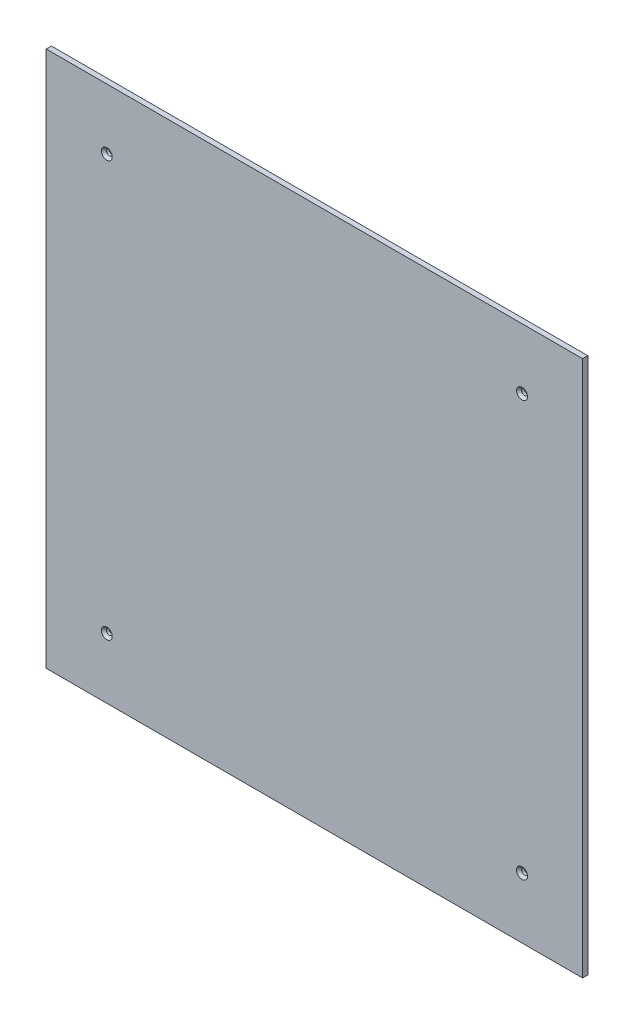
ISO-10303-21;
HEADER;
FILE_DESCRIPTION(('STEP AP214'),'2;1');
FILE_NAME('part.step','',(''),(''),'','','');
FILE_SCHEMA(('AUTOMOTIVE_DESIGN { 1 0 10303 214 1 1 1 1 }'));
ENDSEC;
DATA;
#1=APPLICATION_CONTEXT('core data for automotive mechanical design processes');
#2=APPLICATION_PROTOCOL_DEFINITION('international standard','automotive_design',2000,#1);
#3=PRODUCT_CONTEXT('',#1,'mechanical');
#4=PRODUCT('Part','Part','',(#3));
#5=PRODUCT_RELATED_PRODUCT_CATEGORY('part','',(#4));
#6=PRODUCT_DEFINITION_FORMATION('','',#4);
#7=PRODUCT_DEFINITION_CONTEXT('part definition',#1,'design');
#8=PRODUCT_DEFINITION('design','',#6,#7);
#9=PRODUCT_DEFINITION_SHAPE('','',#8);
#10=(LENGTH_UNIT() NAMED_UNIT(*) SI_UNIT(.MILLI.,.METRE.));
#11=(NAMED_UNIT(*) PLANE_ANGLE_UNIT() SI_UNIT($,.RADIAN.));
#12=(NAMED_UNIT(*) SI_UNIT($,.STERADIAN.) SOLID_ANGLE_UNIT());
#13=UNCERTAINTY_MEASURE_WITH_UNIT(LENGTH_MEASURE(1.E-05),#10,'distance_accuracy_value','');
#14=(GEOMETRIC_REPRESENTATION_CONTEXT(3) GLOBAL_UNCERTAINTY_ASSIGNED_CONTEXT((#13)) GLOBAL_UNIT_ASSIGNED_CONTEXT((#10,
#11,#12)) REPRESENTATION_CONTEXT('',''));
#15=CARTESIAN_POINT('',(0.,0.,0.));
#16=DIRECTION('',(0.,0.,1.));
#17=DIRECTION('',(1.,0.,0.));
#18=AXIS2_PLACEMENT_3D('',#15,#16,#17);
#19=CARTESIAN_POINT('',(-143.295194508009,104.988558352403,-3.));
#20=DIRECTION('',(-1.,0.,0.));
#21=DIRECTION('',(0.,-1.,0.));
#22=AXIS2_PLACEMENT_3D('',#19,#20,#21);
#23=PLANE('',#22);
#24=DIRECTION('',(0.,-1.,0.));
#25=VECTOR('',#24,1.);
#26=CARTESIAN_POINT('',(-143.295194508009,104.988558352403,0.));
#27=LINE('',#26,#25);
#28=CARTESIAN_POINT('',(-143.295194508009,104.988558352403,0.));
#29=VERTEX_POINT('',#28);
#30=CARTESIAN_POINT('',(-143.295194508009,-205.011441647597,0.));
#31=VERTEX_POINT('',#30);
#32=EDGE_CURVE('E110',#29,#31,#27,.T.);
#33=ORIENTED_EDGE('',*,*,#32,.F.);
#34=DIRECTION('',(0.,0.,1.));
#35=VECTOR('',#34,1.);
#36=CARTESIAN_POINT('',(-143.295194508009,104.988558352403,-3.));
#37=LINE('',#36,#35);
#38=CARTESIAN_POINT('',(-143.295194508009,104.988558352403,-3.));
#39=VERTEX_POINT('',#38);
#40=EDGE_CURVE('E11',#39,#29,#37,.T.);
#41=ORIENTED_EDGE('',*,*,#40,.F.);
#42=DIRECTION('',(0.,-1.,0.));
#43=VECTOR('',#42,1.);
#44=CARTESIAN_POINT('',(-143.295194508009,104.988558352403,-3.));
#45=LINE('',#44,#43);
#46=CARTESIAN_POINT('',(-143.295194508009,-205.011441647597,-3.));
#47=VERTEX_POINT('',#46);
#48=EDGE_CURVE('E101',#39,#47,#45,.T.);
#49=ORIENTED_EDGE('',*,*,#48,.T.);
#50=DIRECTION('',(0.,0.,1.));
#51=VECTOR('',#50,1.);
#52=CARTESIAN_POINT('',(-143.295194508009,-205.011441647597,-3.));
#53=LINE('',#52,#51);
#54=EDGE_CURVE('E42',#47,#31,#53,.T.);
#55=ORIENTED_EDGE('',*,*,#54,.T.);
#56=EDGE_LOOP('',(#33,#41,#49,#55));
#57=FACE_BOUND('',#56,.T.);
#58=ADVANCED_FACE('F39',(#57),#23,.T.);
#59=CARTESIAN_POINT('',(-143.295194508009,104.988558352403,-3.));
#60=DIRECTION('',(0.,1.,0.));
#61=DIRECTION('',(0.,0.,1.));
#62=AXIS2_PLACEMENT_3D('',#59,#60,#61);
#63=PLANE('',#62);
#64=DIRECTION('',(-1.,0.,0.));
#65=VECTOR('',#64,1.);
#66=CARTESIAN_POINT('',(-143.295194508009,104.988558352403,0.));
#67=LINE('',#66,#65);
#68=CARTESIAN_POINT('',(166.704805491991,104.988558352403,0.));
#69=VERTEX_POINT('',#68);
#70=EDGE_CURVE('E104',#69,#29,#67,.T.);
#71=ORIENTED_EDGE('',*,*,#70,.F.);
#72=DIRECTION('',(0.,0.,1.));
#73=VECTOR('',#72,1.);
#74=CARTESIAN_POINT('',(166.704805491991,104.988558352403,-3.));
#75=LINE('',#74,#73);
#76=CARTESIAN_POINT('',(166.704805491991,104.988558352403,-3.));
#77=VERTEX_POINT('',#76);
#78=EDGE_CURVE('E49',#77,#69,#75,.T.);
#79=ORIENTED_EDGE('',*,*,#78,.F.);
#80=DIRECTION('',(-1.,0.,0.));
#81=VECTOR('',#80,1.);
#82=CARTESIAN_POINT('',(-143.295194508009,104.988558352403,-3.));
#83=LINE('',#82,#81);
#84=EDGE_CURVE('E96',#77,#39,#83,.T.);
#85=ORIENTED_EDGE('',*,*,#84,.T.);
#86=ORIENTED_EDGE('',*,*,#40,.T.);
#87=EDGE_LOOP('',(#71,#79,#85,#86));
#88=FACE_BOUND('',#87,.T.);
#89=ADVANCED_FACE('F127',(#88),#63,.T.);
#90=CARTESIAN_POINT('',(166.704805491991,104.988558352403,-3.));
#91=DIRECTION('',(1.,0.,0.));
#92=DIRECTION('',(0.,1.,0.));
#93=AXIS2_PLACEMENT_3D('',#90,#91,#92);
#94=PLANE('',#93);
#95=DIRECTION('',(0.,1.,0.));
#96=VECTOR('',#95,1.);
#97=CARTESIAN_POINT('',(166.704805491991,104.988558352403,0.));
#98=LINE('',#97,#96);
#99=CARTESIAN_POINT('',(166.704805491991,-205.011441647597,0.));
#100=VERTEX_POINT('',#99);
#101=EDGE_CURVE('E90',#100,#69,#98,.T.);
#102=ORIENTED_EDGE('',*,*,#101,.F.);
#103=DIRECTION('',(0.,0.,1.));
#104=VECTOR('',#103,1.);
#105=CARTESIAN_POINT('',(166.704805491991,-205.011441647597,-3.));
#106=LINE('',#105,#104);
#107=CARTESIAN_POINT('',(166.704805491991,-205.011441647597,-3.));
#108=VERTEX_POINT('',#107);
#109=EDGE_CURVE('E85',#108,#100,#106,.T.);
#110=ORIENTED_EDGE('',*,*,#109,.F.);
#111=DIRECTION('',(0.,1.,0.));
#112=VECTOR('',#111,1.);
#113=CARTESIAN_POINT('',(166.704805491991,104.988558352403,-3.));
#114=LINE('',#113,#112);
#115=EDGE_CURVE('E88',#108,#77,#114,.T.);
#116=ORIENTED_EDGE('',*,*,#115,.T.);
#117=ORIENTED_EDGE('',*,*,#78,.T.);
#118=EDGE_LOOP('',(#102,#110,#116,#117));
#119=FACE_BOUND('',#118,.T.);
#120=ADVANCED_FACE('F87',(#119),#94,.T.);
#121=CARTESIAN_POINT('',(-143.295194508009,-205.011441647597,-3.));
#122=DIRECTION('',(0.,-1.,0.));
#123=DIRECTION('',(0.,0.,-1.));
#124=AXIS2_PLACEMENT_3D('',#121,#122,#123);
#125=PLANE('',#124);
#126=DIRECTION('',(1.,0.,0.));
#127=VECTOR('',#126,1.);
#128=CARTESIAN_POINT('',(-143.295194508009,-205.011441647597,0.));
#129=LINE('',#128,#127);
#130=EDGE_CURVE('E114',#31,#100,#129,.T.);
#131=ORIENTED_EDGE('',*,*,#130,.F.);
#132=ORIENTED_EDGE('',*,*,#54,.F.);
#133=DIRECTION('',(1.,0.,0.));
#134=VECTOR('',#133,1.);
#135=CARTESIAN_POINT('',(-143.295194508009,-205.011441647597,-3.));
#136=LINE('',#135,#134);
#137=EDGE_CURVE('E95',#47,#108,#136,.T.);
#138=ORIENTED_EDGE('',*,*,#137,.T.);
#139=ORIENTED_EDGE('',*,*,#109,.T.);
#140=EDGE_LOOP('',(#131,#132,#138,#139));
#141=FACE_BOUND('',#140,.T.);
#142=ADVANCED_FACE('F99',(#141),#125,.T.);
#143=CARTESIAN_POINT('',(0.,0.,-3.));
#144=DIRECTION('',(0.,0.,1.));
#145=DIRECTION('',(1.,0.,0.));
#146=AXIS2_PLACEMENT_3D('',#143,#144,#145);
#147=PLANE('',#146);
#148=CARTESIAN_POINT('',(-108.295194508009,69.9885583524027,-3.));
#149=DIRECTION('',(0.,0.,1.));
#150=DIRECTION('',(1.,0.,0.));
#151=AXIS2_PLACEMENT_3D('',#148,#149,#150);
#152=CIRCLE('',#151,1.69999999999999);
#153=CARTESIAN_POINT('',(-106.595194508009,69.9885583524027,-3.));
#154=VERTEX_POINT('',#153);
#155=EDGE_CURVE('E192',#154,#154,#152,.T.);
#156=ORIENTED_EDGE('',*,*,#155,.T.);
#157=EDGE_LOOP('',(#156));
#158=FACE_BOUND('',#157,.T.);
#159=CARTESIAN_POINT('',(131.704805491991,69.9885583524027,-3.));
#160=DIRECTION('',(0.,0.,1.));
#161=DIRECTION('',(1.,0.,0.));
#162=AXIS2_PLACEMENT_3D('',#159,#160,#161);
#163=CIRCLE('',#162,1.70000000000001);
#164=CARTESIAN_POINT('',(133.404805491991,69.9885583524027,-3.));
#165=VERTEX_POINT('',#164);
#166=EDGE_CURVE('E205',#165,#165,#163,.T.);
#167=ORIENTED_EDGE('',*,*,#166,.T.);
#168=EDGE_LOOP('',(#167));
#169=FACE_BOUND('',#168,.T.);
#170=CARTESIAN_POINT('',(131.704805491991,-170.011441647597,-3.));
#171=DIRECTION('',(0.,0.,1.));
#172=DIRECTION('',(1.,0.,0.));
#173=AXIS2_PLACEMENT_3D('',#170,#171,#172);
#174=CIRCLE('',#173,1.70000000000001);
#175=CARTESIAN_POINT('',(133.404805491991,-170.011441647597,-3.));
#176=VERTEX_POINT('',#175);
#177=EDGE_CURVE('E217',#176,#176,#174,.T.);
#178=ORIENTED_EDGE('',*,*,#177,.T.);
#179=EDGE_LOOP('',(#178));
#180=FACE_BOUND('',#179,.T.);
#181=CARTESIAN_POINT('',(-108.295194508009,-170.011441647597,-3.));
#182=DIRECTION('',(0.,0.,1.));
#183=DIRECTION('',(1.,0.,0.));
#184=AXIS2_PLACEMENT_3D('',#181,#182,#183);
#185=CIRCLE('',#184,1.69999999999999);
#186=CARTESIAN_POINT('',(-106.595194508009,-170.011441647597,-3.));
#187=VERTEX_POINT('',#186);
#188=EDGE_CURVE('E115',#187,#187,#185,.T.);
#189=ORIENTED_EDGE('',*,*,#188,.T.);
#190=EDGE_LOOP('',(#189));
#191=FACE_BOUND('',#190,.T.);
#192=ORIENTED_EDGE('',*,*,#48,.F.);
#193=ORIENTED_EDGE('',*,*,#84,.F.);
#194=ORIENTED_EDGE('',*,*,#115,.F.);
#195=ORIENTED_EDGE('',*,*,#137,.F.);
#196=EDGE_LOOP('',(#192,#193,#194,#195));
#197=FACE_BOUND('',#196,.T.);
#198=ADVANCED_FACE('F94',(#158,#169,#180,#191,#197),#147,.F.);
#199=CARTESIAN_POINT('',(0.,0.,0.));
#200=DIRECTION('',(0.,0.,1.));
#201=DIRECTION('',(1.,0.,0.));
#202=AXIS2_PLACEMENT_3D('',#199,#200,#201);
#203=PLANE('',#202);
#204=CARTESIAN_POINT('',(-108.295194508009,69.9885583524027,0.));
#205=DIRECTION('',(0.,0.,1.));
#206=DIRECTION('',(1.,0.,0.));
#207=AXIS2_PLACEMENT_3D('',#204,#205,#206);
#208=CIRCLE('',#207,3.15);
#209=CARTESIAN_POINT('',(-105.145194508009,69.9885583524027,0.));
#210=VERTEX_POINT('',#209);
#211=EDGE_CURVE('E188',#210,#210,#208,.T.);
#212=ORIENTED_EDGE('',*,*,#211,.F.);
#213=EDGE_LOOP('',(#212));
#214=FACE_BOUND('',#213,.T.);
#215=CARTESIAN_POINT('',(131.704805491991,69.9885583524027,0.));
#216=DIRECTION('',(0.,0.,1.));
#217=DIRECTION('',(1.,0.,0.));
#218=AXIS2_PLACEMENT_3D('',#215,#216,#217);
#219=CIRCLE('',#218,3.15000000000001);
#220=CARTESIAN_POINT('',(134.854805491991,69.9885583524027,0.));
#221=VERTEX_POINT('',#220);
#222=EDGE_CURVE('E197',#221,#221,#219,.T.);
#223=ORIENTED_EDGE('',*,*,#222,.F.);
#224=EDGE_LOOP('',(#223));
#225=FACE_BOUND('',#224,.T.);
#226=CARTESIAN_POINT('',(131.704805491991,-170.011441647597,0.));
#227=DIRECTION('',(0.,0.,1.));
#228=DIRECTION('',(1.,0.,0.));
#229=AXIS2_PLACEMENT_3D('',#226,#227,#228);
#230=CIRCLE('',#229,3.14999999999999);
#231=CARTESIAN_POINT('',(134.854805491991,-170.011441647597,0.));
#232=VERTEX_POINT('',#231);
#233=EDGE_CURVE('E209',#232,#232,#230,.T.);
#234=ORIENTED_EDGE('',*,*,#233,.F.);
#235=EDGE_LOOP('',(#234));
#236=FACE_BOUND('',#235,.T.);
#237=CARTESIAN_POINT('',(-108.295194508009,-170.011441647597,0.));
#238=DIRECTION('',(0.,0.,1.));
#239=DIRECTION('',(1.,0.,0.));
#240=AXIS2_PLACEMENT_3D('',#237,#238,#239);
#241=CIRCLE('',#240,3.15);
#242=CARTESIAN_POINT('',(-105.145194508009,-170.011441647597,0.));
#243=VERTEX_POINT('',#242);
#244=EDGE_CURVE('E221',#243,#243,#241,.T.);
#245=ORIENTED_EDGE('',*,*,#244,.F.);
#246=EDGE_LOOP('',(#245));
#247=FACE_BOUND('',#246,.T.);
#248=ORIENTED_EDGE('',*,*,#32,.T.);
#249=ORIENTED_EDGE('',*,*,#130,.T.);
#250=ORIENTED_EDGE('',*,*,#101,.T.);
#251=ORIENTED_EDGE('',*,*,#70,.T.);
#252=EDGE_LOOP('',(#248,#249,#250,#251));
#253=FACE_BOUND('',#252,.T.);
#254=ADVANCED_FACE('F126',(#214,#225,#236,#247,#253),#203,.T.);
#255=CARTESIAN_POINT('',(-108.295194508009,-170.011441647597,0.));
#256=DIRECTION('',(0.,0.,1.));
#257=DIRECTION('',(1.,0.,0.));
#258=AXIS2_PLACEMENT_3D('',#255,#256,#257);
#259=CYLINDRICAL_SURFACE('',#258,1.69999999999999);
#260=ORIENTED_EDGE('',*,*,#188,.F.);
#261=EDGE_LOOP('',(#260));
#262=FACE_BOUND('',#261,.T.);
#263=CARTESIAN_POINT('',(-108.295194508009,-170.011441647597,-1.45));
#264=DIRECTION('',(0.,0.,1.));
#265=DIRECTION('',(1.,0.,0.));
#266=AXIS2_PLACEMENT_3D('',#263,#264,#265);
#267=CIRCLE('',#266,1.69999999999999);
#268=CARTESIAN_POINT('',(-106.595194508009,-170.011441647597,-1.45));
#269=VERTEX_POINT('',#268);
#270=EDGE_CURVE('E225',#269,#269,#267,.T.);
#271=ORIENTED_EDGE('',*,*,#270,.T.);
#272=EDGE_LOOP('',(#271));
#273=FACE_BOUND('',#272,.T.);
#274=ADVANCED_FACE('F145',(#262,#273),#259,.F.);
#275=CARTESIAN_POINT('',(-108.295194508009,-170.011441647597,0.));
#276=DIRECTION('',(0.,0.,1.));
#277=DIRECTION('',(1.,0.,0.));
#278=AXIS2_PLACEMENT_3D('',#275,#276,#277);
#279=CONICAL_SURFACE('',#278,3.15,0.785398163397451);
#280=ORIENTED_EDGE('',*,*,#270,.F.);
#281=EDGE_LOOP('',(#280));
#282=FACE_BOUND('',#281,.T.);
#283=ORIENTED_EDGE('',*,*,#244,.T.);
#284=EDGE_LOOP('',(#283));
#285=FACE_BOUND('',#284,.T.);
#286=ADVANCED_FACE('F152',(#282,#285),#279,.F.);
#287=CARTESIAN_POINT('',(131.704805491991,-170.011441647597,0.));
#288=DIRECTION('',(0.,0.,1.));
#289=DIRECTION('',(1.,0.,0.));
#290=AXIS2_PLACEMENT_3D('',#287,#288,#289);
#291=CYLINDRICAL_SURFACE('',#290,1.70000000000001);
#292=ORIENTED_EDGE('',*,*,#177,.F.);
#293=EDGE_LOOP('',(#292));
#294=FACE_BOUND('',#293,.T.);
#295=CARTESIAN_POINT('',(131.704805491991,-170.011441647597,-1.45));
#296=DIRECTION('',(0.,0.,1.));
#297=DIRECTION('',(1.,0.,0.));
#298=AXIS2_PLACEMENT_3D('',#295,#296,#297);
#299=CIRCLE('',#298,1.70000000000001);
#300=CARTESIAN_POINT('',(133.404805491991,-170.011441647597,-1.45));
#301=VERTEX_POINT('',#300);
#302=EDGE_CURVE('E213',#301,#301,#299,.T.);
#303=ORIENTED_EDGE('',*,*,#302,.T.);
#304=EDGE_LOOP('',(#303));
#305=FACE_BOUND('',#304,.T.);
#306=ADVANCED_FACE('F156',(#294,#305),#291,.F.);
#307=CARTESIAN_POINT('',(131.704805491991,-170.011441647597,0.));
#308=DIRECTION('',(0.,0.,1.));
#309=DIRECTION('',(1.,0.,0.));
#310=AXIS2_PLACEMENT_3D('',#307,#308,#309);
#311=CONICAL_SURFACE('',#310,3.14999999999999,0.785398163397441);
#312=ORIENTED_EDGE('',*,*,#302,.F.);
#313=EDGE_LOOP('',(#312));
#314=FACE_BOUND('',#313,.T.);
#315=ORIENTED_EDGE('',*,*,#233,.T.);
#316=EDGE_LOOP('',(#315));
#317=FACE_BOUND('',#316,.T.);
#318=ADVANCED_FACE('F160',(#314,#317),#311,.F.);
#319=CARTESIAN_POINT('',(131.704805491991,69.9885583524027,0.));
#320=DIRECTION('',(0.,0.,1.));
#321=DIRECTION('',(1.,0.,0.));
#322=AXIS2_PLACEMENT_3D('',#319,#320,#321);
#323=CYLINDRICAL_SURFACE('',#322,1.70000000000001);
#324=ORIENTED_EDGE('',*,*,#166,.F.);
#325=EDGE_LOOP('',(#324));
#326=FACE_BOUND('',#325,.T.);
#327=CARTESIAN_POINT('',(131.704805491991,69.9885583524027,-1.45));
#328=DIRECTION('',(0.,0.,1.));
#329=DIRECTION('',(1.,0.,0.));
#330=AXIS2_PLACEMENT_3D('',#327,#328,#329);
#331=CIRCLE('',#330,1.70000000000001);
#332=CARTESIAN_POINT('',(133.404805491991,69.9885583524027,-1.45));
#333=VERTEX_POINT('',#332);
#334=EDGE_CURVE('E201',#333,#333,#331,.T.);
#335=ORIENTED_EDGE('',*,*,#334,.T.);
#336=EDGE_LOOP('',(#335));
#337=FACE_BOUND('',#336,.T.);
#338=ADVANCED_FACE('F164',(#326,#337),#323,.F.);
#339=CARTESIAN_POINT('',(131.704805491991,69.9885583524027,0.));
#340=DIRECTION('',(0.,0.,1.));
#341=DIRECTION('',(1.,0.,0.));
#342=AXIS2_PLACEMENT_3D('',#339,#340,#341);
#343=CONICAL_SURFACE('',#342,3.15000000000001,0.785398163397451);
#344=ORIENTED_EDGE('',*,*,#334,.F.);
#345=EDGE_LOOP('',(#344));
#346=FACE_BOUND('',#345,.T.);
#347=ORIENTED_EDGE('',*,*,#222,.T.);
#348=EDGE_LOOP('',(#347));
#349=FACE_BOUND('',#348,.T.);
#350=ADVANCED_FACE('F168',(#346,#349),#343,.F.);
#351=CARTESIAN_POINT('',(-108.295194508009,69.9885583524027,0.));
#352=DIRECTION('',(0.,0.,1.));
#353=DIRECTION('',(1.,0.,0.));
#354=AXIS2_PLACEMENT_3D('',#351,#352,#353);
#355=CYLINDRICAL_SURFACE('',#354,1.69999999999999);
#356=ORIENTED_EDGE('',*,*,#155,.F.);
#357=EDGE_LOOP('',(#356));
#358=FACE_BOUND('',#357,.T.);
#359=CARTESIAN_POINT('',(-108.295194508009,69.9885583524027,-1.45));
#360=DIRECTION('',(0.,0.,1.));
#361=DIRECTION('',(1.,0.,0.));
#362=AXIS2_PLACEMENT_3D('',#359,#360,#361);
#363=CIRCLE('',#362,1.69999999999999);
#364=CARTESIAN_POINT('',(-106.595194508009,69.9885583524027,-1.45));
#365=VERTEX_POINT('',#364);
#366=EDGE_CURVE('E185',#365,#365,#363,.T.);
#367=ORIENTED_EDGE('',*,*,#366,.T.);
#368=EDGE_LOOP('',(#367));
#369=FACE_BOUND('',#368,.T.);
#370=ADVANCED_FACE('F172',(#358,#369),#355,.F.);
#371=CARTESIAN_POINT('',(-108.295194508009,69.9885583524027,0.));
#372=DIRECTION('',(0.,0.,1.));
#373=DIRECTION('',(1.,0.,0.));
#374=AXIS2_PLACEMENT_3D('',#371,#372,#373);
#375=CONICAL_SURFACE('',#374,3.15,0.785398163397451);
#376=ORIENTED_EDGE('',*,*,#366,.F.);
#377=EDGE_LOOP('',(#376));
#378=FACE_BOUND('',#377,.T.);
#379=ORIENTED_EDGE('',*,*,#211,.T.);
#380=EDGE_LOOP('',(#379));
#381=FACE_BOUND('',#380,.T.);
#382=ADVANCED_FACE('F176',(#378,#381),#375,.F.);
#383=CLOSED_SHELL('',(#58,#89,#120,#142,#198,#254,#274,#286,#306,#318,#338,#350,#370,#382));
#384=MANIFOLD_SOLID_BREP('B2',#383);
#385=ADVANCED_BREP_SHAPE_REPRESENTATION('',(#18,#384),#14);
#386=SHAPE_DEFINITION_REPRESENTATION(#9,#385);
ENDSEC;
END-ISO-10303-21;
